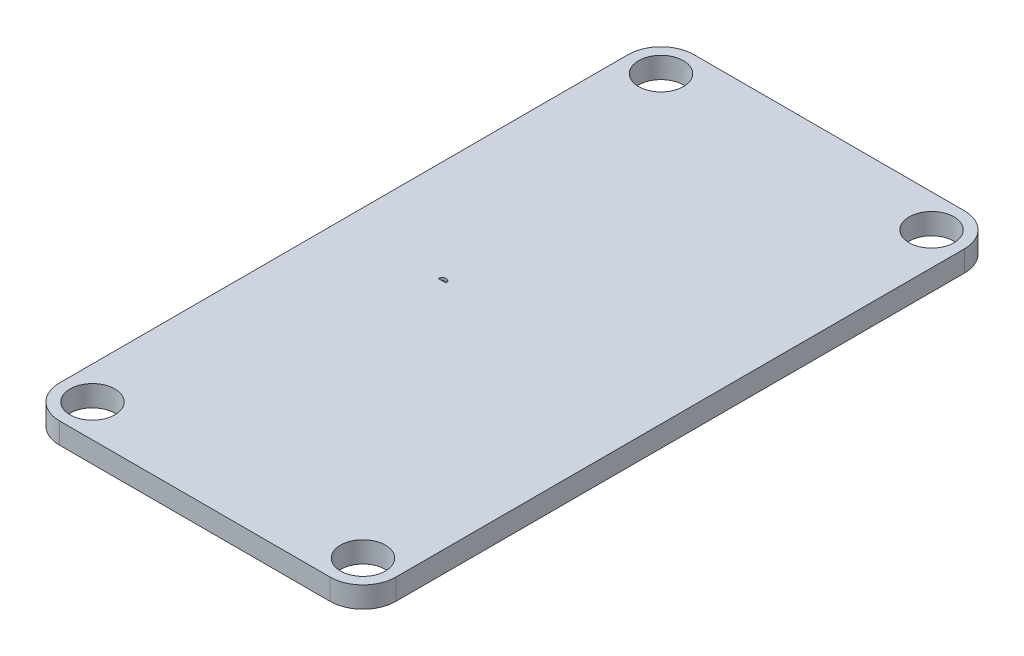
ISO-10303-21;
HEADER;
FILE_DESCRIPTION(('STEP AP214'),'2;1');
FILE_NAME('part.step','',(''),(''),'','','');
FILE_SCHEMA(('AUTOMOTIVE_DESIGN { 1 0 10303 214 1 1 1 1 }'));
ENDSEC;
DATA;
#1=APPLICATION_CONTEXT('core data for automotive mechanical design processes');
#2=APPLICATION_PROTOCOL_DEFINITION('international standard','automotive_design',2000,#1);
#3=PRODUCT_CONTEXT('',#1,'mechanical');
#4=PRODUCT('Part','Part','',(#3));
#5=PRODUCT_RELATED_PRODUCT_CATEGORY('part','',(#4));
#6=PRODUCT_DEFINITION_FORMATION('','',#4);
#7=PRODUCT_DEFINITION_CONTEXT('part definition',#1,'design');
#8=PRODUCT_DEFINITION('design','',#6,#7);
#9=PRODUCT_DEFINITION_SHAPE('','',#8);
#10=(LENGTH_UNIT() NAMED_UNIT(*) SI_UNIT(.MILLI.,.METRE.));
#11=(NAMED_UNIT(*) PLANE_ANGLE_UNIT() SI_UNIT($,.RADIAN.));
#12=(NAMED_UNIT(*) SI_UNIT($,.STERADIAN.) SOLID_ANGLE_UNIT());
#13=UNCERTAINTY_MEASURE_WITH_UNIT(LENGTH_MEASURE(1.E-05),#10,'distance_accuracy_value','');
#14=(GEOMETRIC_REPRESENTATION_CONTEXT(3) GLOBAL_UNCERTAINTY_ASSIGNED_CONTEXT((#13)) GLOBAL_UNIT_ASSIGNED_CONTEXT((#10,
#11,#12)) REPRESENTATION_CONTEXT('',''));
#15=CARTESIAN_POINT('',(0.,0.,0.));
#16=DIRECTION('',(0.,0.,1.));
#17=DIRECTION('',(1.,0.,0.));
#18=AXIS2_PLACEMENT_3D('',#15,#16,#17);
#19=CARTESIAN_POINT('',(7.82275411488327,1.4,-23.8975817938132));
#20=DIRECTION('',(0.,1.,0.));
#21=DIRECTION('',(0.,0.,1.));
#22=AXIS2_PLACEMENT_3D('',#19,#20,#21);
#23=PLANE('',#22);
#24=CARTESIAN_POINT('',(7.82275411488327,1.4,-23.7475817938132));
#25=DIRECTION('',(0.,-1.,0.));
#26=DIRECTION('',(0.,0.,-1.));
#27=AXIS2_PLACEMENT_3D('',#24,#25,#26);
#28=CIRCLE('',#27,0.299999999999998);
#29=CARTESIAN_POINT('',(8.12275411488327,1.4,-23.7475817938132));
#30=VERTEX_POINT('',#29);
#31=CARTESIAN_POINT('',(7.52275411488327,1.4,-23.7475817938132));
#32=VERTEX_POINT('',#31);
#33=EDGE_CURVE('E19',#30,#32,#28,.F.);
#34=ORIENTED_EDGE('',*,*,#33,.T.);
#35=DIRECTION('',(1.,0.,0.));
#36=VECTOR('',#35,1.);
#37=CARTESIAN_POINT('',(8.12275411488327,1.4,-23.7475817938132));
#38=LINE('',#37,#36);
#39=EDGE_CURVE('E90',#32,#30,#38,.T.);
#40=ORIENTED_EDGE('',*,*,#39,.T.);
#41=EDGE_LOOP('',(#34,#40));
#42=FACE_BOUND('',#41,.T.);
#43=ADVANCED_FACE('F16',(#42),#23,.T.);
#44=CARTESIAN_POINT('',(8.12275411488327,1.6,-23.7475817938132));
#45=DIRECTION('',(0.,0.,1.));
#46=DIRECTION('',(1.,0.,0.));
#47=AXIS2_PLACEMENT_3D('',#44,#45,#46);
#48=PLANE('',#47);
#49=DIRECTION('',(0.,-1.,0.));
#50=VECTOR('',#49,1.);
#51=CARTESIAN_POINT('',(8.12275411488327,1.6,-23.7475817938132));
#52=LINE('',#51,#50);
#53=CARTESIAN_POINT('',(8.12275411488327,1.6,-23.7475817938132));
#54=VERTEX_POINT('',#53);
#55=EDGE_CURVE('E100',#54,#30,#52,.T.);
#56=ORIENTED_EDGE('',*,*,#55,.T.);
#57=ORIENTED_EDGE('',*,*,#39,.F.);
#58=DIRECTION('',(0.,-1.,0.));
#59=VECTOR('',#58,1.);
#60=CARTESIAN_POINT('',(7.52275411488327,1.6,-23.7475817938132));
#61=LINE('',#60,#59);
#62=CARTESIAN_POINT('',(7.52275411488327,1.6,-23.7475817938132));
#63=VERTEX_POINT('',#62);
#64=EDGE_CURVE('E98',#32,#63,#61,.F.);
#65=ORIENTED_EDGE('',*,*,#64,.T.);
#66=DIRECTION('',(1.,0.,0.));
#67=VECTOR('',#66,1.);
#68=CARTESIAN_POINT('',(12.775,1.6,-23.7475817938132));
#69=LINE('',#68,#67);
#70=EDGE_CURVE('E106',#54,#63,#69,.F.);
#71=ORIENTED_EDGE('',*,*,#70,.F.);
#72=EDGE_LOOP('',(#56,#57,#65,#71));
#73=FACE_BOUND('',#72,.T.);
#74=ADVANCED_FACE('F96',(#73),#48,.F.);
#75=CARTESIAN_POINT('',(7.82275411488327,1.6,-23.7475817938132));
#76=DIRECTION('',(0.,-1.,0.));
#77=DIRECTION('',(0.,0.,-1.));
#78=AXIS2_PLACEMENT_3D('',#75,#76,#77);
#79=CYLINDRICAL_SURFACE('',#78,0.299999999999998);
#80=ORIENTED_EDGE('',*,*,#64,.F.);
#81=ORIENTED_EDGE('',*,*,#33,.F.);
#82=ORIENTED_EDGE('',*,*,#55,.F.);
#83=CARTESIAN_POINT('',(7.82275411488327,1.6,-23.7475817938132));
#84=DIRECTION('',(0.,-1.,0.));
#85=DIRECTION('',(0.,0.,-1.));
#86=AXIS2_PLACEMENT_3D('',#83,#84,#85);
#87=CIRCLE('',#86,0.299999999999998);
#88=EDGE_CURVE('E105',#63,#54,#87,.T.);
#89=ORIENTED_EDGE('',*,*,#88,.F.);
#90=EDGE_LOOP('',(#80,#81,#82,#89));
#91=FACE_BOUND('',#90,.T.);
#92=ADVANCED_FACE('F103',(#91),#79,.F.);
#93=CARTESIAN_POINT('',(12.775,1.6,-24.095));
#94=DIRECTION('',(0.,1.,0.));
#95=DIRECTION('',(0.,0.,1.));
#96=AXIS2_PLACEMENT_3D('',#93,#94,#95);
#97=PLANE('',#96);
#98=CARTESIAN_POINT('',(23.05,1.6,-2.5));
#99=DIRECTION('',(0.,-1.,0.));
#100=DIRECTION('',(0.,0.,-1.));
#101=AXIS2_PLACEMENT_3D('',#98,#99,#100);
#102=CIRCLE('',#101,1.70527340201852);
#103=CARTESIAN_POINT('',(23.05,1.6,-4.20527340201852));
#104=VERTEX_POINT('',#103);
#105=EDGE_CURVE('E134',#104,#104,#102,.T.);
#106=ORIENTED_EDGE('',*,*,#105,.T.);
#107=EDGE_LOOP('',(#106));
#108=FACE_BOUND('',#107,.T.);
#109=CARTESIAN_POINT('',(23.05,1.6,-45.69));
#110=DIRECTION('',(0.,-1.,0.));
#111=DIRECTION('',(0.,0.,-1.));
#112=AXIS2_PLACEMENT_3D('',#109,#110,#111);
#113=CIRCLE('',#112,1.70527340201852);
#114=CARTESIAN_POINT('',(23.05,1.6,-47.3952734020185));
#115=VERTEX_POINT('',#114);
#116=EDGE_CURVE('E137',#115,#115,#113,.T.);
#117=ORIENTED_EDGE('',*,*,#116,.T.);
#118=EDGE_LOOP('',(#117));
#119=FACE_BOUND('',#118,.T.);
#120=CARTESIAN_POINT('',(2.5,1.6,-2.5));
#121=DIRECTION('',(0.,-1.,0.));
#122=DIRECTION('',(0.,0.,-1.));
#123=AXIS2_PLACEMENT_3D('',#120,#121,#122);
#124=CIRCLE('',#123,1.70527340201852);
#125=CARTESIAN_POINT('',(2.5,1.6,-4.20527340201852));
#126=VERTEX_POINT('',#125);
#127=EDGE_CURVE('E140',#126,#126,#124,.T.);
#128=ORIENTED_EDGE('',*,*,#127,.T.);
#129=EDGE_LOOP('',(#128));
#130=FACE_BOUND('',#129,.T.);
#131=CARTESIAN_POINT('',(2.5,1.6,-45.69));
#132=DIRECTION('',(0.,-1.,0.));
#133=DIRECTION('',(0.,0.,-1.));
#134=AXIS2_PLACEMENT_3D('',#131,#132,#133);
#135=CIRCLE('',#134,1.70527340201852);
#136=CARTESIAN_POINT('',(2.5,1.6,-47.3952734020185));
#137=VERTEX_POINT('',#136);
#138=EDGE_CURVE('E143',#137,#137,#135,.T.);
#139=ORIENTED_EDGE('',*,*,#138,.T.);
#140=EDGE_LOOP('',(#139));
#141=FACE_BOUND('',#140,.T.);
#142=ORIENTED_EDGE('',*,*,#70,.T.);
#143=ORIENTED_EDGE('',*,*,#88,.T.);
#144=EDGE_LOOP('',(#142,#143));
#145=FACE_BOUND('',#144,.T.);
#146=CARTESIAN_POINT('',(23.05,1.6,-2.5));
#147=DIRECTION('',(0.,1.,0.));
#148=DIRECTION('',(0.,0.,1.));
#149=AXIS2_PLACEMENT_3D('',#146,#147,#148);
#150=CIRCLE('',#149,2.5);
#151=CARTESIAN_POINT('',(25.55,1.6,-2.5));
#152=VERTEX_POINT('',#151);
#153=CARTESIAN_POINT('',(23.05,1.6,0.));
#154=VERTEX_POINT('',#153);
#155=EDGE_CURVE('E150',#152,#154,#150,.F.);
#156=ORIENTED_EDGE('',*,*,#155,.F.);
#157=DIRECTION('',(0.,0.,-1.));
#158=VECTOR('',#157,1.);
#159=CARTESIAN_POINT('',(25.55,1.6,0.));
#160=LINE('',#159,#158);
#161=CARTESIAN_POINT('',(25.55,1.6,-45.69));
#162=VERTEX_POINT('',#161);
#163=EDGE_CURVE('E167',#162,#152,#160,.F.);
#164=ORIENTED_EDGE('',*,*,#163,.F.);
#165=CARTESIAN_POINT('',(23.05,1.6,-45.69));
#166=DIRECTION('',(0.,1.,0.));
#167=DIRECTION('',(0.,0.,1.));
#168=AXIS2_PLACEMENT_3D('',#165,#166,#167);
#169=CIRCLE('',#168,2.5);
#170=CARTESIAN_POINT('',(23.05,1.6,-48.19));
#171=VERTEX_POINT('',#170);
#172=EDGE_CURVE('E147',#171,#162,#169,.F.);
#173=ORIENTED_EDGE('',*,*,#172,.F.);
#174=DIRECTION('',(-1.,0.,0.));
#175=VECTOR('',#174,1.);
#176=CARTESIAN_POINT('',(25.55,1.6,-48.19));
#177=LINE('',#176,#175);
#178=CARTESIAN_POINT('',(2.5,1.6,-48.19));
#179=VERTEX_POINT('',#178);
#180=EDGE_CURVE('E160',#179,#171,#177,.F.);
#181=ORIENTED_EDGE('',*,*,#180,.F.);
#182=CARTESIAN_POINT('',(2.5,1.6,-45.69));
#183=DIRECTION('',(0.,1.,0.));
#184=DIRECTION('',(0.,0.,1.));
#185=AXIS2_PLACEMENT_3D('',#182,#183,#184);
#186=CIRCLE('',#185,2.5);
#187=CARTESIAN_POINT('',(0.,1.6,-45.69));
#188=VERTEX_POINT('',#187);
#189=EDGE_CURVE('E158',#188,#179,#186,.F.);
#190=ORIENTED_EDGE('',*,*,#189,.F.);
#191=DIRECTION('',(0.,0.,1.));
#192=VECTOR('',#191,1.);
#193=CARTESIAN_POINT('',(0.,1.6,-48.19));
#194=LINE('',#193,#192);
#195=CARTESIAN_POINT('',(0.,1.6,-2.5));
#196=VERTEX_POINT('',#195);
#197=EDGE_CURVE('E157',#196,#188,#194,.F.);
#198=ORIENTED_EDGE('',*,*,#197,.F.);
#199=CARTESIAN_POINT('',(2.5,1.6,-2.5));
#200=DIRECTION('',(0.,1.,0.));
#201=DIRECTION('',(0.,0.,1.));
#202=AXIS2_PLACEMENT_3D('',#199,#200,#201);
#203=CIRCLE('',#202,2.5);
#204=CARTESIAN_POINT('',(2.5,1.6,0.));
#205=VERTEX_POINT('',#204);
#206=EDGE_CURVE('E154',#205,#196,#203,.F.);
#207=ORIENTED_EDGE('',*,*,#206,.F.);
#208=DIRECTION('',(1.,0.,0.));
#209=VECTOR('',#208,1.);
#210=CARTESIAN_POINT('',(0.,1.6,0.));
#211=LINE('',#210,#209);
#212=EDGE_CURVE('E153',#154,#205,#211,.F.);
#213=ORIENTED_EDGE('',*,*,#212,.F.);
#214=EDGE_LOOP('',(#156,#164,#173,#181,#190,#198,#207,#213));
#215=FACE_BOUND('',#214,.T.);
#216=ADVANCED_FACE('F263',(#108,#119,#130,#141,#145,#215),#97,.T.);
#217=CARTESIAN_POINT('',(25.55,0.,-48.19));
#218=DIRECTION('',(0.,0.,-1.));
#219=DIRECTION('',(-1.,0.,0.));
#220=AXIS2_PLACEMENT_3D('',#217,#218,#219);
#221=PLANE('',#220);
#222=DIRECTION('',(0.,1.,0.));
#223=VECTOR('',#222,1.);
#224=CARTESIAN_POINT('',(2.5,0.,-48.19));
#225=LINE('',#224,#223);
#226=CARTESIAN_POINT('',(2.5,0.,-48.19));
#227=VERTEX_POINT('',#226);
#228=EDGE_CURVE('E159',#179,#227,#225,.F.);
#229=ORIENTED_EDGE('',*,*,#228,.F.);
#230=ORIENTED_EDGE('',*,*,#180,.T.);
#231=DIRECTION('',(0.,1.,0.));
#232=VECTOR('',#231,1.);
#233=CARTESIAN_POINT('',(23.05,0.,-48.19));
#234=LINE('',#233,#232);
#235=CARTESIAN_POINT('',(23.05,0.,-48.19));
#236=VERTEX_POINT('',#235);
#237=EDGE_CURVE('E146',#236,#171,#234,.T.);
#238=ORIENTED_EDGE('',*,*,#237,.F.);
#239=DIRECTION('',(1.,0.,0.));
#240=VECTOR('',#239,1.);
#241=CARTESIAN_POINT('',(12.775,0.,-48.19));
#242=LINE('',#241,#240);
#243=EDGE_CURVE('E133',#236,#227,#242,.F.);
#244=ORIENTED_EDGE('',*,*,#243,.T.);
#245=EDGE_LOOP('',(#229,#230,#238,#244));
#246=FACE_BOUND('',#245,.T.);
#247=ADVANCED_FACE('F219',(#246),#221,.T.);
#248=CARTESIAN_POINT('',(2.5,0.,-45.69));
#249=DIRECTION('',(0.,1.,0.));
#250=DIRECTION('',(0.,0.,1.));
#251=AXIS2_PLACEMENT_3D('',#248,#249,#250);
#252=CYLINDRICAL_SURFACE('',#251,2.5);
#253=CARTESIAN_POINT('',(2.5,0.,-45.69));
#254=DIRECTION('',(0.,1.,0.));
#255=DIRECTION('',(0.,0.,1.));
#256=AXIS2_PLACEMENT_3D('',#253,#254,#255);
#257=CIRCLE('',#256,2.5);
#258=CARTESIAN_POINT('',(0.,0.,-45.69));
#259=VERTEX_POINT('',#258);
#260=EDGE_CURVE('E130',#227,#259,#257,.T.);
#261=ORIENTED_EDGE('',*,*,#260,.T.);
#262=DIRECTION('',(0.,1.,0.));
#263=VECTOR('',#262,1.);
#264=CARTESIAN_POINT('',(0.,0.,-45.69));
#265=LINE('',#264,#263);
#266=EDGE_CURVE('E172',#188,#259,#265,.F.);
#267=ORIENTED_EDGE('',*,*,#266,.F.);
#268=ORIENTED_EDGE('',*,*,#189,.T.);
#269=ORIENTED_EDGE('',*,*,#228,.T.);
#270=EDGE_LOOP('',(#261,#267,#268,#269));
#271=FACE_BOUND('',#270,.T.);
#272=ADVANCED_FACE('F215',(#271),#252,.T.);
#273=CARTESIAN_POINT('',(0.,0.,-48.19));
#274=DIRECTION('',(-1.,0.,0.));
#275=DIRECTION('',(0.,0.,1.));
#276=AXIS2_PLACEMENT_3D('',#273,#274,#275);
#277=PLANE('',#276);
#278=DIRECTION('',(0.,1.,0.));
#279=VECTOR('',#278,1.);
#280=CARTESIAN_POINT('',(0.,0.,-2.5));
#281=LINE('',#280,#279);
#282=CARTESIAN_POINT('',(0.,0.,-2.5));
#283=VERTEX_POINT('',#282);
#284=EDGE_CURVE('E156',#196,#283,#281,.F.);
#285=ORIENTED_EDGE('',*,*,#284,.F.);
#286=ORIENTED_EDGE('',*,*,#197,.T.);
#287=ORIENTED_EDGE('',*,*,#266,.T.);
#288=DIRECTION('',(0.,0.,1.));
#289=VECTOR('',#288,1.);
#290=CARTESIAN_POINT('',(0.,0.,-24.095));
#291=LINE('',#290,#289);
#292=EDGE_CURVE('E129',#259,#283,#291,.T.);
#293=ORIENTED_EDGE('',*,*,#292,.T.);
#294=EDGE_LOOP('',(#285,#286,#287,#293));
#295=FACE_BOUND('',#294,.T.);
#296=ADVANCED_FACE('F212',(#295),#277,.T.);
#297=CARTESIAN_POINT('',(2.5,0.,-2.5));
#298=DIRECTION('',(0.,1.,0.));
#299=DIRECTION('',(0.,0.,1.));
#300=AXIS2_PLACEMENT_3D('',#297,#298,#299);
#301=CYLINDRICAL_SURFACE('',#300,2.5);
#302=CARTESIAN_POINT('',(2.5,0.,-2.5));
#303=DIRECTION('',(0.,1.,0.));
#304=DIRECTION('',(0.,0.,1.));
#305=AXIS2_PLACEMENT_3D('',#302,#303,#304);
#306=CIRCLE('',#305,2.5);
#307=CARTESIAN_POINT('',(2.5,0.,0.));
#308=VERTEX_POINT('',#307);
#309=EDGE_CURVE('E126',#283,#308,#306,.T.);
#310=ORIENTED_EDGE('',*,*,#309,.T.);
#311=DIRECTION('',(0.,1.,0.));
#312=VECTOR('',#311,1.);
#313=CARTESIAN_POINT('',(2.5,0.,0.));
#314=LINE('',#313,#312);
#315=EDGE_CURVE('E170',#205,#308,#314,.F.);
#316=ORIENTED_EDGE('',*,*,#315,.F.);
#317=ORIENTED_EDGE('',*,*,#206,.T.);
#318=ORIENTED_EDGE('',*,*,#284,.T.);
#319=EDGE_LOOP('',(#310,#316,#317,#318));
#320=FACE_BOUND('',#319,.T.);
#321=ADVANCED_FACE('F211',(#320),#301,.T.);
#322=CARTESIAN_POINT('',(0.,0.,0.));
#323=DIRECTION('',(0.,0.,1.));
#324=DIRECTION('',(1.,0.,0.));
#325=AXIS2_PLACEMENT_3D('',#322,#323,#324);
#326=PLANE('',#325);
#327=DIRECTION('',(0.,1.,0.));
#328=VECTOR('',#327,1.);
#329=CARTESIAN_POINT('',(23.05,0.,0.));
#330=LINE('',#329,#328);
#331=CARTESIAN_POINT('',(23.05,0.,0.));
#332=VERTEX_POINT('',#331);
#333=EDGE_CURVE('E152',#154,#332,#330,.F.);
#334=ORIENTED_EDGE('',*,*,#333,.F.);
#335=ORIENTED_EDGE('',*,*,#212,.T.);
#336=ORIENTED_EDGE('',*,*,#315,.T.);
#337=DIRECTION('',(1.,0.,0.));
#338=VECTOR('',#337,1.);
#339=CARTESIAN_POINT('',(12.775,0.,0.));
#340=LINE('',#339,#338);
#341=EDGE_CURVE('E125',#308,#332,#340,.T.);
#342=ORIENTED_EDGE('',*,*,#341,.T.);
#343=EDGE_LOOP('',(#334,#335,#336,#342));
#344=FACE_BOUND('',#343,.T.);
#345=ADVANCED_FACE('F207',(#344),#326,.T.);
#346=CARTESIAN_POINT('',(23.05,0.,-2.5));
#347=DIRECTION('',(0.,1.,0.));
#348=DIRECTION('',(0.,0.,1.));
#349=AXIS2_PLACEMENT_3D('',#346,#347,#348);
#350=CYLINDRICAL_SURFACE('',#349,2.5);
#351=CARTESIAN_POINT('',(23.05,0.,-2.5));
#352=DIRECTION('',(0.,1.,0.));
#353=DIRECTION('',(0.,0.,1.));
#354=AXIS2_PLACEMENT_3D('',#351,#352,#353);
#355=CIRCLE('',#354,2.5);
#356=CARTESIAN_POINT('',(25.55,0.,-2.5));
#357=VERTEX_POINT('',#356);
#358=EDGE_CURVE('E122',#332,#357,#355,.T.);
#359=ORIENTED_EDGE('',*,*,#358,.T.);
#360=DIRECTION('',(0.,1.,0.));
#361=VECTOR('',#360,1.);
#362=CARTESIAN_POINT('',(25.55,0.,-2.5));
#363=LINE('',#362,#361);
#364=EDGE_CURVE('E149',#152,#357,#363,.F.);
#365=ORIENTED_EDGE('',*,*,#364,.F.);
#366=ORIENTED_EDGE('',*,*,#155,.T.);
#367=ORIENTED_EDGE('',*,*,#333,.T.);
#368=EDGE_LOOP('',(#359,#365,#366,#367));
#369=FACE_BOUND('',#368,.T.);
#370=ADVANCED_FACE('F202',(#369),#350,.T.);
#371=CARTESIAN_POINT('',(25.55,0.,0.));
#372=DIRECTION('',(1.,0.,0.));
#373=DIRECTION('',(0.,0.,-1.));
#374=AXIS2_PLACEMENT_3D('',#371,#372,#373);
#375=PLANE('',#374);
#376=ORIENTED_EDGE('',*,*,#364,.T.);
#377=DIRECTION('',(0.,0.,1.));
#378=VECTOR('',#377,1.);
#379=CARTESIAN_POINT('',(25.55,0.,-24.095));
#380=LINE('',#379,#378);
#381=CARTESIAN_POINT('',(25.55,0.,-45.69));
#382=VERTEX_POINT('',#381);
#383=EDGE_CURVE('E121',#357,#382,#380,.F.);
#384=ORIENTED_EDGE('',*,*,#383,.T.);
#385=DIRECTION('',(0.,1.,0.));
#386=VECTOR('',#385,1.);
#387=CARTESIAN_POINT('',(25.55,0.,-45.69));
#388=LINE('',#387,#386);
#389=EDGE_CURVE('E34',#162,#382,#388,.F.);
#390=ORIENTED_EDGE('',*,*,#389,.F.);
#391=ORIENTED_EDGE('',*,*,#163,.T.);
#392=EDGE_LOOP('',(#376,#384,#390,#391));
#393=FACE_BOUND('',#392,.T.);
#394=ADVANCED_FACE('F195',(#393),#375,.T.);
#395=CARTESIAN_POINT('',(23.05,0.,-45.69));
#396=DIRECTION('',(0.,1.,0.));
#397=DIRECTION('',(0.,0.,1.));
#398=AXIS2_PLACEMENT_3D('',#395,#396,#397);
#399=CYLINDRICAL_SURFACE('',#398,2.5);
#400=CARTESIAN_POINT('',(23.05,0.,-45.69));
#401=DIRECTION('',(0.,1.,0.));
#402=DIRECTION('',(0.,0.,1.));
#403=AXIS2_PLACEMENT_3D('',#400,#401,#402);
#404=CIRCLE('',#403,2.5);
#405=EDGE_CURVE('E119',#382,#236,#404,.T.);
#406=ORIENTED_EDGE('',*,*,#405,.T.);
#407=ORIENTED_EDGE('',*,*,#237,.T.);
#408=ORIENTED_EDGE('',*,*,#172,.T.);
#409=ORIENTED_EDGE('',*,*,#389,.T.);
#410=EDGE_LOOP('',(#406,#407,#408,#409));
#411=FACE_BOUND('',#410,.T.);
#412=ADVANCED_FACE('F222',(#411),#399,.T.);
#413=CARTESIAN_POINT('',(2.5,1.6,-45.69));
#414=DIRECTION('',(0.,-1.,0.));
#415=DIRECTION('',(0.,0.,-1.));
#416=AXIS2_PLACEMENT_3D('',#413,#414,#415);
#417=CYLINDRICAL_SURFACE('',#416,1.70527340201852);
#418=ORIENTED_EDGE('',*,*,#138,.F.);
#419=EDGE_LOOP('',(#418));
#420=FACE_BOUND('',#419,.T.);
#421=CARTESIAN_POINT('',(2.5,0.,-45.69));
#422=DIRECTION('',(0.,-1.,0.));
#423=DIRECTION('',(0.,0.,-1.));
#424=AXIS2_PLACEMENT_3D('',#421,#422,#423);
#425=CIRCLE('',#424,1.70527340201852);
#426=CARTESIAN_POINT('',(2.5,0.,-47.3952734020185));
#427=VERTEX_POINT('',#426);
#428=EDGE_CURVE('E116',#427,#427,#425,.T.);
#429=ORIENTED_EDGE('',*,*,#428,.T.);
#430=EDGE_LOOP('',(#429));
#431=FACE_BOUND('',#430,.T.);
#432=ADVANCED_FACE('F224',(#420,#431),#417,.F.);
#433=CARTESIAN_POINT('',(2.5,1.6,-2.5));
#434=DIRECTION('',(0.,-1.,0.));
#435=DIRECTION('',(0.,0.,-1.));
#436=AXIS2_PLACEMENT_3D('',#433,#434,#435);
#437=CYLINDRICAL_SURFACE('',#436,1.70527340201852);
#438=ORIENTED_EDGE('',*,*,#127,.F.);
#439=EDGE_LOOP('',(#438));
#440=FACE_BOUND('',#439,.T.);
#441=CARTESIAN_POINT('',(2.5,0.,-2.5));
#442=DIRECTION('',(0.,-1.,0.));
#443=DIRECTION('',(0.,0.,-1.));
#444=AXIS2_PLACEMENT_3D('',#441,#442,#443);
#445=CIRCLE('',#444,1.70527340201852);
#446=CARTESIAN_POINT('',(2.5,0.,-4.20527340201852));
#447=VERTEX_POINT('',#446);
#448=EDGE_CURVE('E113',#447,#447,#445,.T.);
#449=ORIENTED_EDGE('',*,*,#448,.T.);
#450=EDGE_LOOP('',(#449));
#451=FACE_BOUND('',#450,.T.);
#452=ADVANCED_FACE('F231',(#440,#451),#437,.F.);
#453=CARTESIAN_POINT('',(23.05,1.6,-45.69));
#454=DIRECTION('',(0.,-1.,0.));
#455=DIRECTION('',(0.,0.,-1.));
#456=AXIS2_PLACEMENT_3D('',#453,#454,#455);
#457=CYLINDRICAL_SURFACE('',#456,1.70527340201852);
#458=ORIENTED_EDGE('',*,*,#116,.F.);
#459=EDGE_LOOP('',(#458));
#460=FACE_BOUND('',#459,.T.);
#461=CARTESIAN_POINT('',(23.05,0.,-45.69));
#462=DIRECTION('',(0.,-1.,0.));
#463=DIRECTION('',(0.,0.,-1.));
#464=AXIS2_PLACEMENT_3D('',#461,#462,#463);
#465=CIRCLE('',#464,1.70527340201852);
#466=CARTESIAN_POINT('',(23.05,0.,-47.3952734020185));
#467=VERTEX_POINT('',#466);
#468=EDGE_CURVE('E25',#467,#467,#465,.T.);
#469=ORIENTED_EDGE('',*,*,#468,.T.);
#470=EDGE_LOOP('',(#469));
#471=FACE_BOUND('',#470,.T.);
#472=ADVANCED_FACE('F242',(#460,#471),#457,.F.);
#473=CARTESIAN_POINT('',(23.05,1.6,-2.5));
#474=DIRECTION('',(0.,-1.,0.));
#475=DIRECTION('',(0.,0.,-1.));
#476=AXIS2_PLACEMENT_3D('',#473,#474,#475);
#477=CYLINDRICAL_SURFACE('',#476,1.70527340201852);
#478=ORIENTED_EDGE('',*,*,#105,.F.);
#479=EDGE_LOOP('',(#478));
#480=FACE_BOUND('',#479,.T.);
#481=CARTESIAN_POINT('',(23.05,0.,-2.5));
#482=DIRECTION('',(0.,-1.,0.));
#483=DIRECTION('',(0.,0.,-1.));
#484=AXIS2_PLACEMENT_3D('',#481,#482,#483);
#485=CIRCLE('',#484,1.70527340201852);
#486=CARTESIAN_POINT('',(23.05,0.,-4.20527340201852));
#487=VERTEX_POINT('',#486);
#488=EDGE_CURVE('E11',#487,#487,#485,.T.);
#489=ORIENTED_EDGE('',*,*,#488,.T.);
#490=EDGE_LOOP('',(#489));
#491=FACE_BOUND('',#490,.T.);
#492=ADVANCED_FACE('F236',(#480,#491),#477,.F.);
#493=CARTESIAN_POINT('',(12.775,0.,-24.095));
#494=DIRECTION('',(0.,1.,0.));
#495=DIRECTION('',(0.,0.,1.));
#496=AXIS2_PLACEMENT_3D('',#493,#494,#495);
#497=PLANE('',#496);
#498=ORIENTED_EDGE('',*,*,#488,.F.);
#499=EDGE_LOOP('',(#498));
#500=FACE_BOUND('',#499,.T.);
#501=ORIENTED_EDGE('',*,*,#468,.F.);
#502=EDGE_LOOP('',(#501));
#503=FACE_BOUND('',#502,.T.);
#504=ORIENTED_EDGE('',*,*,#448,.F.);
#505=EDGE_LOOP('',(#504));
#506=FACE_BOUND('',#505,.T.);
#507=ORIENTED_EDGE('',*,*,#428,.F.);
#508=EDGE_LOOP('',(#507));
#509=FACE_BOUND('',#508,.T.);
#510=ORIENTED_EDGE('',*,*,#383,.F.);
#511=ORIENTED_EDGE('',*,*,#358,.F.);
#512=ORIENTED_EDGE('',*,*,#341,.F.);
#513=ORIENTED_EDGE('',*,*,#309,.F.);
#514=ORIENTED_EDGE('',*,*,#292,.F.);
#515=ORIENTED_EDGE('',*,*,#260,.F.);
#516=ORIENTED_EDGE('',*,*,#243,.F.);
#517=ORIENTED_EDGE('',*,*,#405,.F.);
#518=EDGE_LOOP('',(#510,#511,#512,#513,#514,#515,#516,#517));
#519=FACE_BOUND('',#518,.T.);
#520=ADVANCED_FACE('F199',(#500,#503,#506,#509,#519),#497,.F.);
#521=CLOSED_SHELL('',(#43,#74,#92,#216,#247,#272,#296,#321,#345,#370,#394,#412,#432,#452,#472,
#492,#520));
#522=MANIFOLD_SOLID_BREP('B1',#521);
#523=ADVANCED_BREP_SHAPE_REPRESENTATION('',(#18,#522),#14);
#524=SHAPE_DEFINITION_REPRESENTATION(#9,#523);
ENDSEC;
END-ISO-10303-21;
